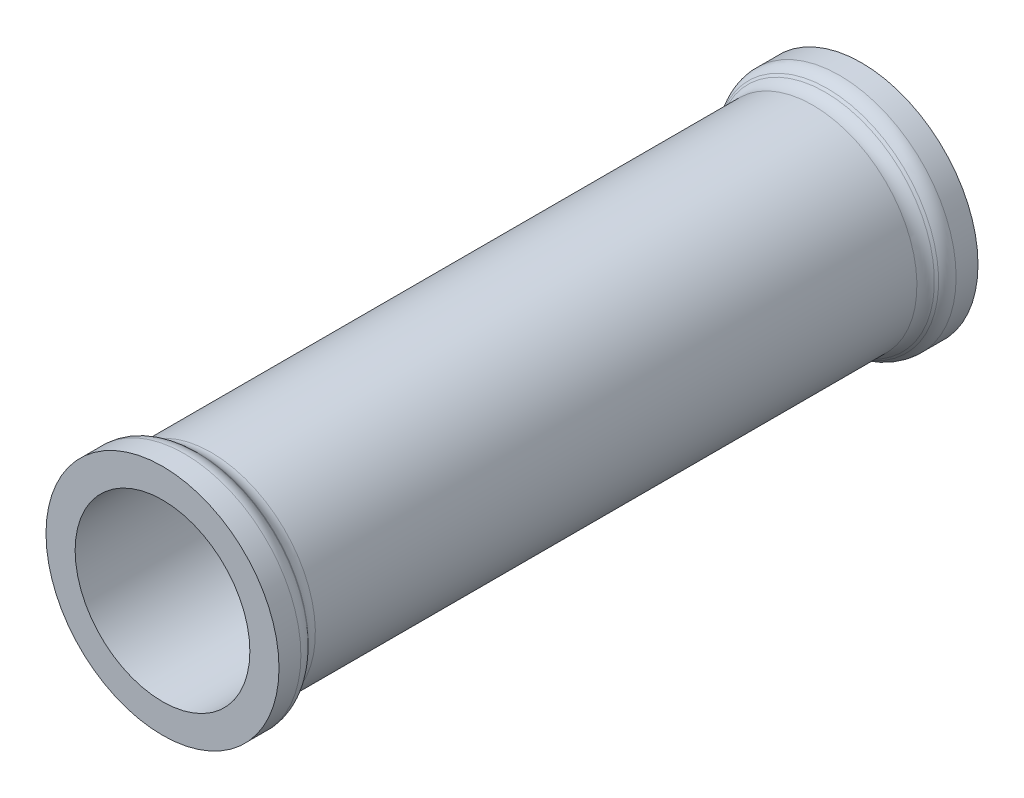
ISO-10303-21;
HEADER;
FILE_DESCRIPTION(('STEP AP214'),'2;1');
FILE_NAME('part.step','',(''),(''),'','','');
FILE_SCHEMA(('AUTOMOTIVE_DESIGN { 1 0 10303 214 1 1 1 1 }'));
ENDSEC;
DATA;
#1=APPLICATION_CONTEXT('core data for automotive mechanical design processes');
#2=APPLICATION_PROTOCOL_DEFINITION('international standard','automotive_design',2000,#1);
#3=PRODUCT_CONTEXT('',#1,'mechanical');
#4=PRODUCT('Part','Part','',(#3));
#5=PRODUCT_RELATED_PRODUCT_CATEGORY('part','',(#4));
#6=PRODUCT_DEFINITION_FORMATION('','',#4);
#7=PRODUCT_DEFINITION_CONTEXT('part definition',#1,'design');
#8=PRODUCT_DEFINITION('design','',#6,#7);
#9=PRODUCT_DEFINITION_SHAPE('','',#8);
#10=(LENGTH_UNIT() NAMED_UNIT(*) SI_UNIT(.MILLI.,.METRE.));
#11=(NAMED_UNIT(*) PLANE_ANGLE_UNIT() SI_UNIT($,.RADIAN.));
#12=(NAMED_UNIT(*) SI_UNIT($,.STERADIAN.) SOLID_ANGLE_UNIT());
#13=UNCERTAINTY_MEASURE_WITH_UNIT(LENGTH_MEASURE(1.E-05),#10,'distance_accuracy_value','');
#14=(GEOMETRIC_REPRESENTATION_CONTEXT(3) GLOBAL_UNCERTAINTY_ASSIGNED_CONTEXT((#13)) GLOBAL_UNIT_ASSIGNED_CONTEXT((#10,
#11,#12)) REPRESENTATION_CONTEXT('',''));
#15=CARTESIAN_POINT('',(0.,0.,0.));
#16=DIRECTION('',(0.,0.,1.));
#17=DIRECTION('',(1.,0.,0.));
#18=AXIS2_PLACEMENT_3D('',#15,#16,#17);
#19=CARTESIAN_POINT('',(0.,0.,3.75735931288072));
#20=DIRECTION('',(0.,0.,-1.));
#21=DIRECTION('',(0.,1.,0.));
#22=AXIS2_PLACEMENT_3D('',#19,#20,#21);
#23=TOROIDAL_SURFACE('',#22,17.,3.);
#24=CARTESIAN_POINT('',(0.,0.,3.75735931288072));
#25=DIRECTION('',(0.,0.,-1.));
#26=DIRECTION('',(0.,1.,0.));
#27=AXIS2_PLACEMENT_3D('',#24,#25,#26);
#28=CIRCLE('',#27,20.);
#29=CARTESIAN_POINT('',(0.,20.,3.75735931288072));
#30=VERTEX_POINT('',#29);
#31=EDGE_CURVE('E10',#30,#30,#28,.T.);
#32=ORIENTED_EDGE('',*,*,#31,.F.);
#33=EDGE_LOOP('',(#32));
#34=FACE_BOUND('',#33,.T.);
#35=CARTESIAN_POINT('',(0.,0.,5.87867965644036));
#36=DIRECTION('',(0.,0.,-1.));
#37=DIRECTION('',(0.,1.,0.));
#38=AXIS2_PLACEMENT_3D('',#35,#36,#37);
#39=CIRCLE('',#38,19.1213203435596);
#40=CARTESIAN_POINT('',(0.,19.1213203435596,5.87867965644036));
#41=VERTEX_POINT('',#40);
#42=EDGE_CURVE('E71',#41,#41,#39,.T.);
#43=ORIENTED_EDGE('',*,*,#42,.T.);
#44=EDGE_LOOP('',(#43));
#45=FACE_BOUND('',#44,.T.);
#46=ADVANCED_FACE('F37',(#34,#45),#23,.T.);
#47=CARTESIAN_POINT('',(0.,0.,0.));
#48=DIRECTION('',(0.,0.,-1.));
#49=DIRECTION('',(0.,1.,0.));
#50=AXIS2_PLACEMENT_3D('',#47,#48,#49);
#51=CYLINDRICAL_SURFACE('',#50,20.);
#52=CARTESIAN_POINT('',(0.,0.,0.));
#53=DIRECTION('',(0.,0.,-1.));
#54=DIRECTION('',(0.,1.,0.));
#55=AXIS2_PLACEMENT_3D('',#52,#53,#54);
#56=CIRCLE('',#55,20.);
#57=CARTESIAN_POINT('',(0.,20.,0.));
#58=VERTEX_POINT('',#57);
#59=EDGE_CURVE('E43',#58,#58,#56,.T.);
#60=ORIENTED_EDGE('',*,*,#59,.F.);
#61=EDGE_LOOP('',(#60));
#62=FACE_BOUND('',#61,.T.);
#63=ORIENTED_EDGE('',*,*,#31,.T.);
#64=EDGE_LOOP('',(#63));
#65=FACE_BOUND('',#64,.T.);
#66=ADVANCED_FACE('F93',(#62,#65),#51,.T.);
#67=CARTESIAN_POINT('',(0.,-20.,0.));
#68=DIRECTION('',(0.,0.,1.));
#69=DIRECTION('',(0.,-1.,0.));
#70=AXIS2_PLACEMENT_3D('',#67,#68,#69);
#71=PLANE('',#70);
#72=CARTESIAN_POINT('',(0.,0.,0.));
#73=DIRECTION('',(0.,0.,-1.));
#74=DIRECTION('',(0.,1.,0.));
#75=AXIS2_PLACEMENT_3D('',#72,#73,#74);
#76=CIRCLE('',#75,15.);
#77=CARTESIAN_POINT('',(0.,15.,0.));
#78=VERTEX_POINT('',#77);
#79=EDGE_CURVE('E75',#78,#78,#76,.T.);
#80=ORIENTED_EDGE('',*,*,#79,.F.);
#81=EDGE_LOOP('',(#80));
#82=FACE_BOUND('',#81,.T.);
#83=ORIENTED_EDGE('',*,*,#59,.T.);
#84=EDGE_LOOP('',(#83));
#85=FACE_BOUND('',#84,.T.);
#86=ADVANCED_FACE('F91',(#82,#85),#71,.F.);
#87=CARTESIAN_POINT('',(0.,0.,120.));
#88=DIRECTION('',(0.,0.,-1.));
#89=DIRECTION('',(0.,1.,0.));
#90=AXIS2_PLACEMENT_3D('',#87,#88,#89);
#91=PLANE('',#90);
#92=CARTESIAN_POINT('',(0.,0.,120.));
#93=DIRECTION('',(0.,0.,-1.));
#94=DIRECTION('',(0.,1.,0.));
#95=AXIS2_PLACEMENT_3D('',#92,#93,#94);
#96=CIRCLE('',#95,15.);
#97=CARTESIAN_POINT('',(0.,15.,120.));
#98=VERTEX_POINT('',#97);
#99=EDGE_CURVE('E74',#98,#98,#96,.T.);
#100=ORIENTED_EDGE('',*,*,#99,.T.);
#101=EDGE_LOOP('',(#100));
#102=FACE_BOUND('',#101,.T.);
#103=CARTESIAN_POINT('',(0.,0.,120.));
#104=DIRECTION('',(0.,0.,-1.));
#105=DIRECTION('',(0.,1.,0.));
#106=AXIS2_PLACEMENT_3D('',#103,#104,#105);
#107=CIRCLE('',#106,20.);
#108=CARTESIAN_POINT('',(0.,20.,120.));
#109=VERTEX_POINT('',#108);
#110=EDGE_CURVE('E47',#109,#109,#107,.T.);
#111=ORIENTED_EDGE('',*,*,#110,.F.);
#112=EDGE_LOOP('',(#111));
#113=FACE_BOUND('',#112,.T.);
#114=ADVANCED_FACE('F81',(#102,#113),#91,.F.);
#115=CARTESIAN_POINT('',(0.,0.,0.));
#116=DIRECTION('',(0.,0.,-1.));
#117=DIRECTION('',(0.,1.,0.));
#118=AXIS2_PLACEMENT_3D('',#115,#116,#117);
#119=CYLINDRICAL_SURFACE('',#118,20.);
#120=CARTESIAN_POINT('',(0.,0.,116.242640687119));
#121=DIRECTION('',(0.,0.,-1.));
#122=DIRECTION('',(0.,1.,0.));
#123=AXIS2_PLACEMENT_3D('',#120,#121,#122);
#124=CIRCLE('',#123,20.);
#125=CARTESIAN_POINT('',(0.,20.,116.242640687119));
#126=VERTEX_POINT('',#125);
#127=EDGE_CURVE('E51',#126,#126,#124,.T.);
#128=ORIENTED_EDGE('',*,*,#127,.F.);
#129=EDGE_LOOP('',(#128));
#130=FACE_BOUND('',#129,.T.);
#131=ORIENTED_EDGE('',*,*,#110,.T.);
#132=EDGE_LOOP('',(#131));
#133=FACE_BOUND('',#132,.T.);
#134=ADVANCED_FACE('F99',(#130,#133),#119,.T.);
#135=CARTESIAN_POINT('',(0.,0.,116.242640687119));
#136=DIRECTION('',(0.,0.,-1.));
#137=DIRECTION('',(0.,1.,0.));
#138=AXIS2_PLACEMENT_3D('',#135,#136,#137);
#139=TOROIDAL_SURFACE('',#138,17.,3.00000000000001);
#140=CARTESIAN_POINT('',(0.,0.,114.12132034356));
#141=DIRECTION('',(0.,0.,-1.));
#142=DIRECTION('',(0.,1.,0.));
#143=AXIS2_PLACEMENT_3D('',#140,#141,#142);
#144=CIRCLE('',#143,19.1213203435596);
#145=CARTESIAN_POINT('',(0.,19.1213203435596,114.12132034356));
#146=VERTEX_POINT('',#145);
#147=EDGE_CURVE('E56',#146,#146,#144,.T.);
#148=ORIENTED_EDGE('',*,*,#147,.F.);
#149=EDGE_LOOP('',(#148));
#150=FACE_BOUND('',#149,.T.);
#151=ORIENTED_EDGE('',*,*,#127,.T.);
#152=EDGE_LOOP('',(#151));
#153=FACE_BOUND('',#152,.T.);
#154=ADVANCED_FACE('F135',(#150,#153),#139,.T.);
#155=CARTESIAN_POINT('',(0.,0.,114.12132034356));
#156=DIRECTION('',(0.,0.,1.));
#157=DIRECTION('',(0.,-1.,0.));
#158=AXIS2_PLACEMENT_3D('',#155,#156,#157);
#159=CONICAL_SURFACE('',#158,19.1213203435596,0.785398163397467);
#160=CARTESIAN_POINT('',(0.,0.,113.757359312881));
#161=DIRECTION('',(0.,0.,-1.));
#162=DIRECTION('',(0.,1.,0.));
#163=AXIS2_PLACEMENT_3D('',#160,#161,#162);
#164=CIRCLE('',#163,18.7573593128807);
#165=CARTESIAN_POINT('',(0.,18.7573593128807,113.757359312881));
#166=VERTEX_POINT('',#165);
#167=EDGE_CURVE('E59',#166,#166,#164,.T.);
#168=ORIENTED_EDGE('',*,*,#167,.F.);
#169=EDGE_LOOP('',(#168));
#170=FACE_BOUND('',#169,.T.);
#171=ORIENTED_EDGE('',*,*,#147,.T.);
#172=EDGE_LOOP('',(#171));
#173=FACE_BOUND('',#172,.T.);
#174=ADVANCED_FACE('F129',(#170,#173),#159,.T.);
#175=CARTESIAN_POINT('',(0.,0.,111.636038969321));
#176=DIRECTION('',(0.,0.,-1.));
#177=DIRECTION('',(0.,1.,0.));
#178=AXIS2_PLACEMENT_3D('',#175,#176,#177);
#179=TOROIDAL_SURFACE('',#178,20.8786796564403,3.);
#180=CARTESIAN_POINT('',(0.,0.,111.636038969321));
#181=DIRECTION('',(0.,0.,-1.));
#182=DIRECTION('',(0.,1.,0.));
#183=AXIS2_PLACEMENT_3D('',#180,#181,#182);
#184=CIRCLE('',#183,17.8786796564403);
#185=CARTESIAN_POINT('',(0.,17.8786796564403,111.636038969321));
#186=VERTEX_POINT('',#185);
#187=EDGE_CURVE('E62',#186,#186,#184,.T.);
#188=ORIENTED_EDGE('',*,*,#187,.F.);
#189=EDGE_LOOP('',(#188));
#190=FACE_BOUND('',#189,.T.);
#191=ORIENTED_EDGE('',*,*,#167,.T.);
#192=EDGE_LOOP('',(#191));
#193=FACE_BOUND('',#192,.T.);
#194=ADVANCED_FACE('F123',(#190,#193),#179,.F.);
#195=CARTESIAN_POINT('',(0.,0.,0.));
#196=DIRECTION('',(0.,0.,-1.));
#197=DIRECTION('',(0.,1.,0.));
#198=AXIS2_PLACEMENT_3D('',#195,#196,#197);
#199=CYLINDRICAL_SURFACE('',#198,17.8786796564404);
#200=CARTESIAN_POINT('',(0.,0.,8.36396103067891));
#201=DIRECTION('',(0.,0.,-1.));
#202=DIRECTION('',(0.,1.,0.));
#203=AXIS2_PLACEMENT_3D('',#200,#201,#202);
#204=CIRCLE('',#203,17.8786796564404);
#205=CARTESIAN_POINT('',(0.,17.8786796564404,8.36396103067891));
#206=VERTEX_POINT('',#205);
#207=EDGE_CURVE('E65',#206,#206,#204,.T.);
#208=ORIENTED_EDGE('',*,*,#207,.F.);
#209=EDGE_LOOP('',(#208));
#210=FACE_BOUND('',#209,.T.);
#211=ORIENTED_EDGE('',*,*,#187,.T.);
#212=EDGE_LOOP('',(#211));
#213=FACE_BOUND('',#212,.T.);
#214=ADVANCED_FACE('F117',(#210,#213),#199,.T.);
#215=CARTESIAN_POINT('',(0.,0.,8.36396103067891));
#216=DIRECTION('',(0.,0.,-1.));
#217=DIRECTION('',(0.,1.,0.));
#218=AXIS2_PLACEMENT_3D('',#215,#216,#217);
#219=TOROIDAL_SURFACE('',#218,20.8786796564404,3.);
#220=CARTESIAN_POINT('',(0.,0.,6.24264068711927));
#221=DIRECTION('',(0.,0.,-1.));
#222=DIRECTION('',(0.,1.,0.));
#223=AXIS2_PLACEMENT_3D('',#220,#221,#222);
#224=CIRCLE('',#223,18.7573593128807);
#225=CARTESIAN_POINT('',(0.,18.7573593128807,6.24264068711927));
#226=VERTEX_POINT('',#225);
#227=EDGE_CURVE('E68',#226,#226,#224,.T.);
#228=ORIENTED_EDGE('',*,*,#227,.F.);
#229=EDGE_LOOP('',(#228));
#230=FACE_BOUND('',#229,.T.);
#231=ORIENTED_EDGE('',*,*,#207,.T.);
#232=EDGE_LOOP('',(#231));
#233=FACE_BOUND('',#232,.T.);
#234=ADVANCED_FACE('F111',(#230,#233),#219,.F.);
#235=CARTESIAN_POINT('',(0.,0.,6.24264068711927));
#236=DIRECTION('',(0.,0.,-1.));
#237=DIRECTION('',(0.,1.,0.));
#238=AXIS2_PLACEMENT_3D('',#235,#236,#237);
#239=CONICAL_SURFACE('',#238,18.7573593128807,0.785398163397448);
#240=ORIENTED_EDGE('',*,*,#42,.F.);
#241=EDGE_LOOP('',(#240));
#242=FACE_BOUND('',#241,.T.);
#243=ORIENTED_EDGE('',*,*,#227,.T.);
#244=EDGE_LOOP('',(#243));
#245=FACE_BOUND('',#244,.T.);
#246=ADVANCED_FACE('F87',(#242,#245),#239,.T.);
#247=CARTESIAN_POINT('',(0.,0.,120.));
#248=DIRECTION('',(0.,0.,-1.));
#249=DIRECTION('',(0.,1.,0.));
#250=AXIS2_PLACEMENT_3D('',#247,#248,#249);
#251=CYLINDRICAL_SURFACE('',#250,15.);
#252=ORIENTED_EDGE('',*,*,#99,.F.);
#253=EDGE_LOOP('',(#252));
#254=FACE_BOUND('',#253,.T.);
#255=ORIENTED_EDGE('',*,*,#79,.T.);
#256=EDGE_LOOP('',(#255));
#257=FACE_BOUND('',#256,.T.);
#258=ADVANCED_FACE('F84',(#254,#257),#251,.F.);
#259=CLOSED_SHELL('',(#46,#66,#86,#114,#134,#154,#174,#194,#214,#234,#246,#258));
#260=MANIFOLD_SOLID_BREP('B2',#259);
#261=ADVANCED_BREP_SHAPE_REPRESENTATION('',(#18,#260),#14);
#262=SHAPE_DEFINITION_REPRESENTATION(#9,#261);
ENDSEC;
END-ISO-10303-21;
